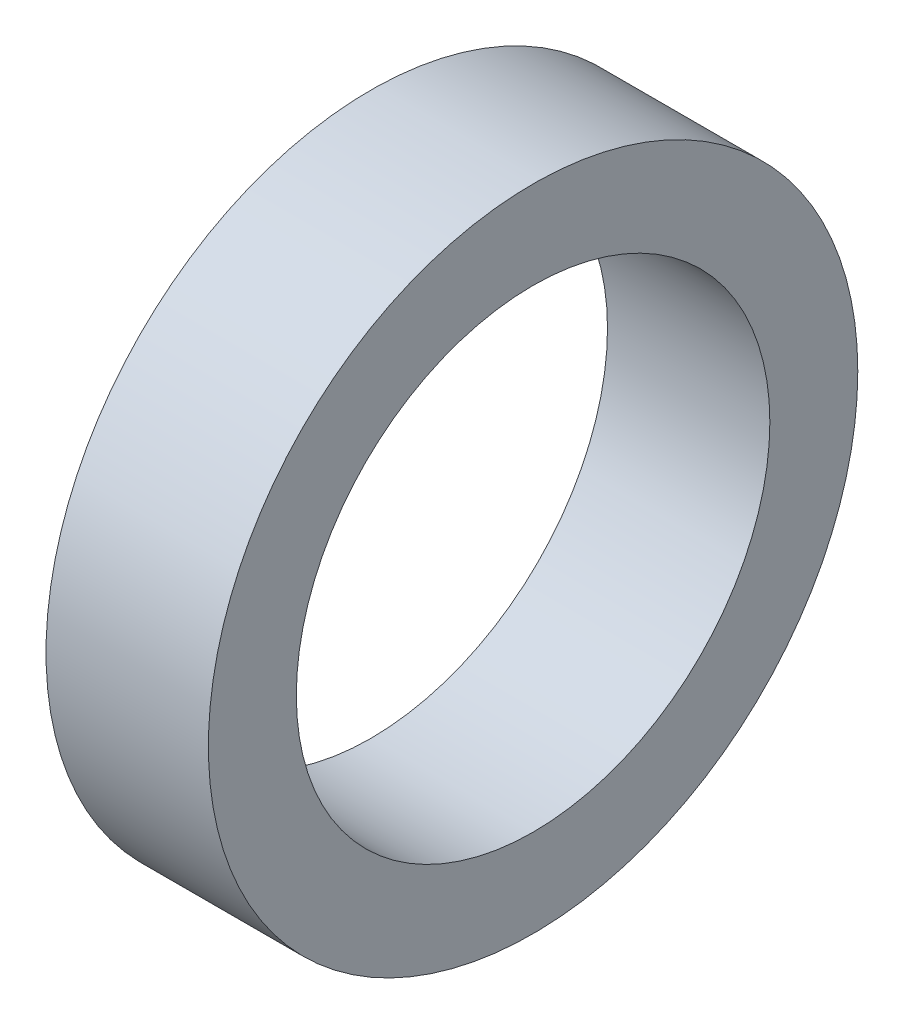
ISO-10303-21;
HEADER;
FILE_DESCRIPTION(('STEP AP214'),'2;1');
FILE_NAME('part.step','',(''),(''),'','','');
FILE_SCHEMA(('AUTOMOTIVE_DESIGN { 1 0 10303 214 1 1 1 1 }'));
ENDSEC;
DATA;
#1=APPLICATION_CONTEXT('core data for automotive mechanical design processes');
#2=APPLICATION_PROTOCOL_DEFINITION('international standard','automotive_design',2000,#1);
#3=PRODUCT_CONTEXT('',#1,'mechanical');
#4=PRODUCT('Part','Part','',(#3));
#5=PRODUCT_RELATED_PRODUCT_CATEGORY('part','',(#4));
#6=PRODUCT_DEFINITION_FORMATION('','',#4);
#7=PRODUCT_DEFINITION_CONTEXT('part definition',#1,'design');
#8=PRODUCT_DEFINITION('design','',#6,#7);
#9=PRODUCT_DEFINITION_SHAPE('','',#8);
#10=(LENGTH_UNIT() NAMED_UNIT(*) SI_UNIT(.MILLI.,.METRE.));
#11=(NAMED_UNIT(*) PLANE_ANGLE_UNIT() SI_UNIT($,.RADIAN.));
#12=(NAMED_UNIT(*) SI_UNIT($,.STERADIAN.) SOLID_ANGLE_UNIT());
#13=UNCERTAINTY_MEASURE_WITH_UNIT(LENGTH_MEASURE(1.E-05),#10,'distance_accuracy_value','');
#14=(GEOMETRIC_REPRESENTATION_CONTEXT(3) GLOBAL_UNCERTAINTY_ASSIGNED_CONTEXT((#13)) GLOBAL_UNIT_ASSIGNED_CONTEXT((#10,
#11,#12)) REPRESENTATION_CONTEXT('',''));
#15=CARTESIAN_POINT('',(0.,0.,0.));
#16=DIRECTION('',(0.,0.,1.));
#17=DIRECTION('',(1.,0.,0.));
#18=AXIS2_PLACEMENT_3D('',#15,#16,#17);
#19=CARTESIAN_POINT('',(6.,0.,0.));
#20=DIRECTION('',(1.,0.,0.));
#21=DIRECTION('',(0.,0.,-1.));
#22=AXIS2_PLACEMENT_3D('',#19,#20,#21);
#23=PLANE('',#22);
#24=CARTESIAN_POINT('',(6.,0.,0.));
#25=DIRECTION('',(1.,0.,0.));
#26=DIRECTION('',(0.,0.,-1.));
#27=AXIS2_PLACEMENT_3D('',#24,#25,#26);
#28=CIRCLE('',#27,12.);
#29=CARTESIAN_POINT('',(6.,0.,-12.));
#30=VERTEX_POINT('',#29);
#31=EDGE_CURVE('E10',#30,#30,#28,.T.);
#32=ORIENTED_EDGE('',*,*,#31,.T.);
#33=EDGE_LOOP('',(#32));
#34=FACE_BOUND('',#33,.T.);
#35=CARTESIAN_POINT('',(6.,0.,0.));
#36=DIRECTION('',(1.,0.,0.));
#37=DIRECTION('',(0.,0.,-1.));
#38=AXIS2_PLACEMENT_3D('',#35,#36,#37);
#39=CIRCLE('',#38,8.75);
#40=CARTESIAN_POINT('',(6.,0.,-8.75));
#41=VERTEX_POINT('',#40);
#42=EDGE_CURVE('E52',#41,#41,#39,.T.);
#43=ORIENTED_EDGE('',*,*,#42,.F.);
#44=EDGE_LOOP('',(#43));
#45=FACE_BOUND('',#44,.T.);
#46=ADVANCED_FACE('F41',(#34,#45),#23,.T.);
#47=CARTESIAN_POINT('',(0.,0.,0.));
#48=DIRECTION('',(1.,0.,0.));
#49=DIRECTION('',(0.,0.,-1.));
#50=AXIS2_PLACEMENT_3D('',#47,#48,#49);
#51=PLANE('',#50);
#52=CARTESIAN_POINT('',(0.,0.,0.));
#53=DIRECTION('',(1.,0.,0.));
#54=DIRECTION('',(0.,0.,-1.));
#55=AXIS2_PLACEMENT_3D('',#52,#53,#54);
#56=CIRCLE('',#55,12.);
#57=CARTESIAN_POINT('',(0.,0.,-12.));
#58=VERTEX_POINT('',#57);
#59=EDGE_CURVE('E45',#58,#58,#56,.T.);
#60=ORIENTED_EDGE('',*,*,#59,.F.);
#61=EDGE_LOOP('',(#60));
#62=FACE_BOUND('',#61,.T.);
#63=CARTESIAN_POINT('',(0.,0.,0.));
#64=DIRECTION('',(1.,0.,0.));
#65=DIRECTION('',(0.,0.,-1.));
#66=AXIS2_PLACEMENT_3D('',#63,#64,#65);
#67=CIRCLE('',#66,8.75);
#68=CARTESIAN_POINT('',(0.,0.,-8.75));
#69=VERTEX_POINT('',#68);
#70=EDGE_CURVE('E54',#69,#69,#67,.T.);
#71=ORIENTED_EDGE('',*,*,#70,.T.);
#72=EDGE_LOOP('',(#71));
#73=FACE_BOUND('',#72,.T.);
#74=ADVANCED_FACE('F64',(#62,#73),#51,.F.);
#75=CARTESIAN_POINT('',(6.,0.,0.));
#76=DIRECTION('',(-1.,0.,0.));
#77=DIRECTION('',(0.,0.,1.));
#78=AXIS2_PLACEMENT_3D('',#75,#76,#77);
#79=CYLINDRICAL_SURFACE('',#78,12.);
#80=ORIENTED_EDGE('',*,*,#31,.F.);
#81=EDGE_LOOP('',(#80));
#82=FACE_BOUND('',#81,.T.);
#83=ORIENTED_EDGE('',*,*,#59,.T.);
#84=EDGE_LOOP('',(#83));
#85=FACE_BOUND('',#84,.T.);
#86=ADVANCED_FACE('F43',(#82,#85),#79,.T.);
#87=CARTESIAN_POINT('',(6.,0.,0.));
#88=DIRECTION('',(-1.,0.,0.));
#89=DIRECTION('',(0.,0.,1.));
#90=AXIS2_PLACEMENT_3D('',#87,#88,#89);
#91=CYLINDRICAL_SURFACE('',#90,8.75);
#92=ORIENTED_EDGE('',*,*,#42,.T.);
#93=EDGE_LOOP('',(#92));
#94=FACE_BOUND('',#93,.T.);
#95=ORIENTED_EDGE('',*,*,#70,.F.);
#96=EDGE_LOOP('',(#95));
#97=FACE_BOUND('',#96,.T.);
#98=ADVANCED_FACE('F60',(#94,#97),#91,.F.);
#99=CLOSED_SHELL('',(#46,#74,#86,#98));
#100=MANIFOLD_SOLID_BREP('B2',#99);
#101=ADVANCED_BREP_SHAPE_REPRESENTATION('',(#18,#100),#14);
#102=SHAPE_DEFINITION_REPRESENTATION(#9,#101);
ENDSEC;
END-ISO-10303-21;
